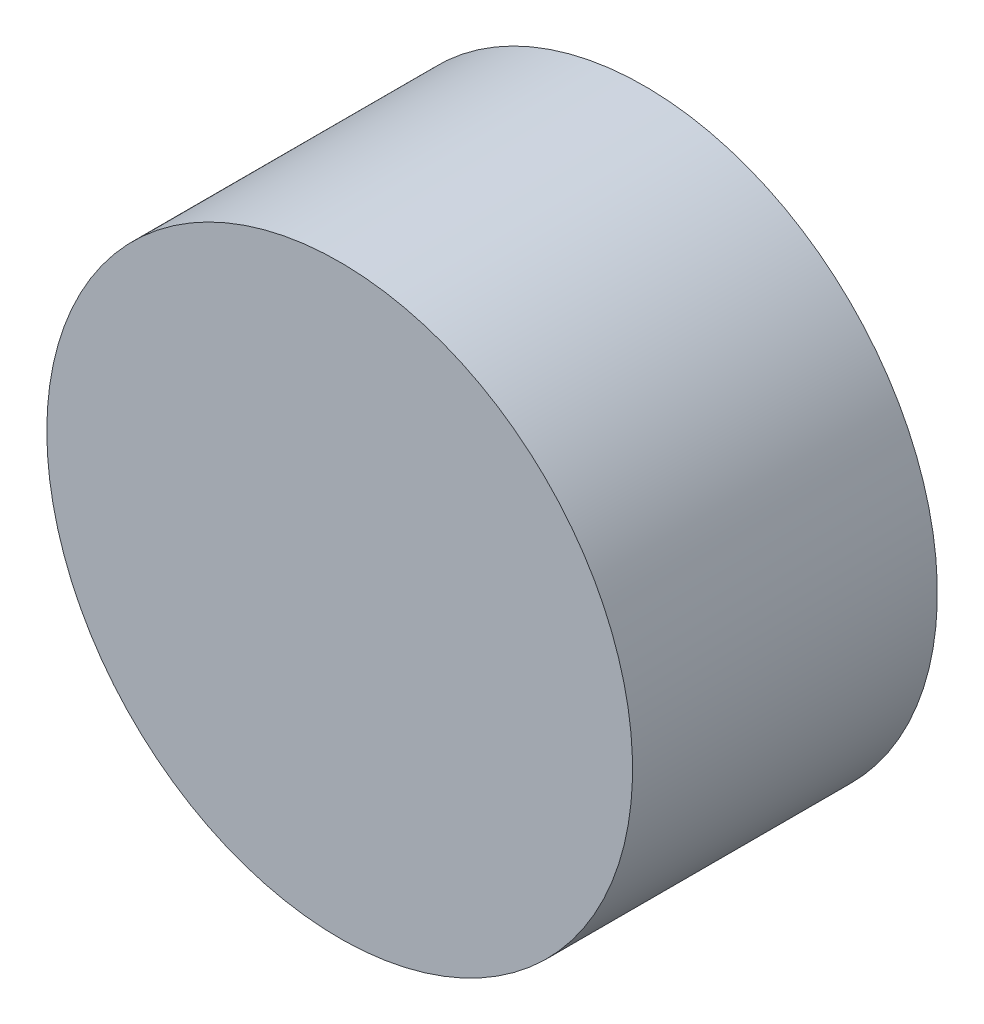
ISO-10303-21;
HEADER;
FILE_DESCRIPTION(('STEP AP214'),'2;1');
FILE_NAME('part.step','',(''),(''),'','','');
FILE_SCHEMA(('AUTOMOTIVE_DESIGN { 1 0 10303 214 1 1 1 1 }'));
ENDSEC;
DATA;
#1=APPLICATION_CONTEXT('core data for automotive mechanical design processes');
#2=APPLICATION_PROTOCOL_DEFINITION('international standard','automotive_design',2000,#1);
#3=PRODUCT_CONTEXT('',#1,'mechanical');
#4=PRODUCT('Part','Part','',(#3));
#5=PRODUCT_RELATED_PRODUCT_CATEGORY('part','',(#4));
#6=PRODUCT_DEFINITION_FORMATION('','',#4);
#7=PRODUCT_DEFINITION_CONTEXT('part definition',#1,'design');
#8=PRODUCT_DEFINITION('design','',#6,#7);
#9=PRODUCT_DEFINITION_SHAPE('','',#8);
#10=(LENGTH_UNIT() NAMED_UNIT(*) SI_UNIT(.MILLI.,.METRE.));
#11=(NAMED_UNIT(*) PLANE_ANGLE_UNIT() SI_UNIT($,.RADIAN.));
#12=(NAMED_UNIT(*) SI_UNIT($,.STERADIAN.) SOLID_ANGLE_UNIT());
#13=UNCERTAINTY_MEASURE_WITH_UNIT(LENGTH_MEASURE(1.E-05),#10,'distance_accuracy_value','');
#14=(GEOMETRIC_REPRESENTATION_CONTEXT(3) GLOBAL_UNCERTAINTY_ASSIGNED_CONTEXT((#13)) GLOBAL_UNIT_ASSIGNED_CONTEXT((#10,
#11,#12)) REPRESENTATION_CONTEXT('',''));
#15=CARTESIAN_POINT('',(0.,0.,0.));
#16=DIRECTION('',(0.,0.,1.));
#17=DIRECTION('',(1.,0.,0.));
#18=AXIS2_PLACEMENT_3D('',#15,#16,#17);
#19=CARTESIAN_POINT('',(-1.63179365853004E-13,-24.8501013000089,1157.82515195));
#20=DIRECTION('',(0.,0.,-1.));
#21=DIRECTION('',(0.,-1.,0.));
#22=AXIS2_PLACEMENT_3D('',#19,#20,#21);
#23=PLANE('',#22);
#24=CARTESIAN_POINT('',(-1.63179365853004E-13,-24.8501013000089,1157.82515195));
#25=DIRECTION('',(0.,0.,-1.));
#26=DIRECTION('',(1.,0.,0.));
#27=AXIS2_PLACEMENT_3D('',#24,#25,#26);
#28=CIRCLE('',#27,30.75);
#29=CARTESIAN_POINT('',(-30.75,-24.8501013000092,1157.82515195));
#30=VERTEX_POINT('',#29);
#31=EDGE_CURVE('E11',#30,#30,#28,.T.);
#32=ORIENTED_EDGE('',*,*,#31,.F.);
#33=EDGE_LOOP('',(#32));
#34=FACE_BOUND('',#33,.T.);
#35=ADVANCED_FACE('F17',(#34),#23,.F.);
#36=CARTESIAN_POINT('',(-1.56453460709401E-13,-24.8501013000089,1125.82515195));
#37=DIRECTION('',(0.,0.,-1.));
#38=DIRECTION('',(0.,-1.,0.));
#39=AXIS2_PLACEMENT_3D('',#36,#37,#38);
#40=PLANE('',#39);
#41=CARTESIAN_POINT('',(-1.56453460709401E-13,-24.8501013000089,1125.82515195));
#42=DIRECTION('',(0.,0.,-1.));
#43=DIRECTION('',(1.,0.,0.));
#44=AXIS2_PLACEMENT_3D('',#41,#42,#43);
#45=CIRCLE('',#44,30.75);
#46=CARTESIAN_POINT('',(-30.75,-24.8501013000092,1125.82515195));
#47=VERTEX_POINT('',#46);
#48=EDGE_CURVE('E21',#47,#47,#45,.T.);
#49=ORIENTED_EDGE('',*,*,#48,.T.);
#50=EDGE_LOOP('',(#49));
#51=FACE_BOUND('',#50,.T.);
#52=ADVANCED_FACE('F19',(#51),#40,.T.);
#53=CARTESIAN_POINT('',(-1.56453460709401E-13,-24.8501013000089,1125.82515195));
#54=DIRECTION('',(0.,0.,1.));
#55=DIRECTION('',(-1.,0.,0.));
#56=AXIS2_PLACEMENT_3D('',#53,#54,#55);
#57=CYLINDRICAL_SURFACE('',#56,30.75);
#58=ORIENTED_EDGE('',*,*,#31,.T.);
#59=EDGE_LOOP('',(#58));
#60=FACE_BOUND('',#59,.T.);
#61=ORIENTED_EDGE('',*,*,#48,.F.);
#62=EDGE_LOOP('',(#61));
#63=FACE_BOUND('',#62,.T.);
#64=ADVANCED_FACE('F67',(#60,#63),#57,.T.);
#65=CLOSED_SHELL('',(#35,#52,#64));
#66=MANIFOLD_SOLID_BREP('B1',#65);
#67=ADVANCED_BREP_SHAPE_REPRESENTATION('',(#18,#66),#14);
#68=SHAPE_DEFINITION_REPRESENTATION(#9,#67);
ENDSEC;
END-ISO-10303-21;
